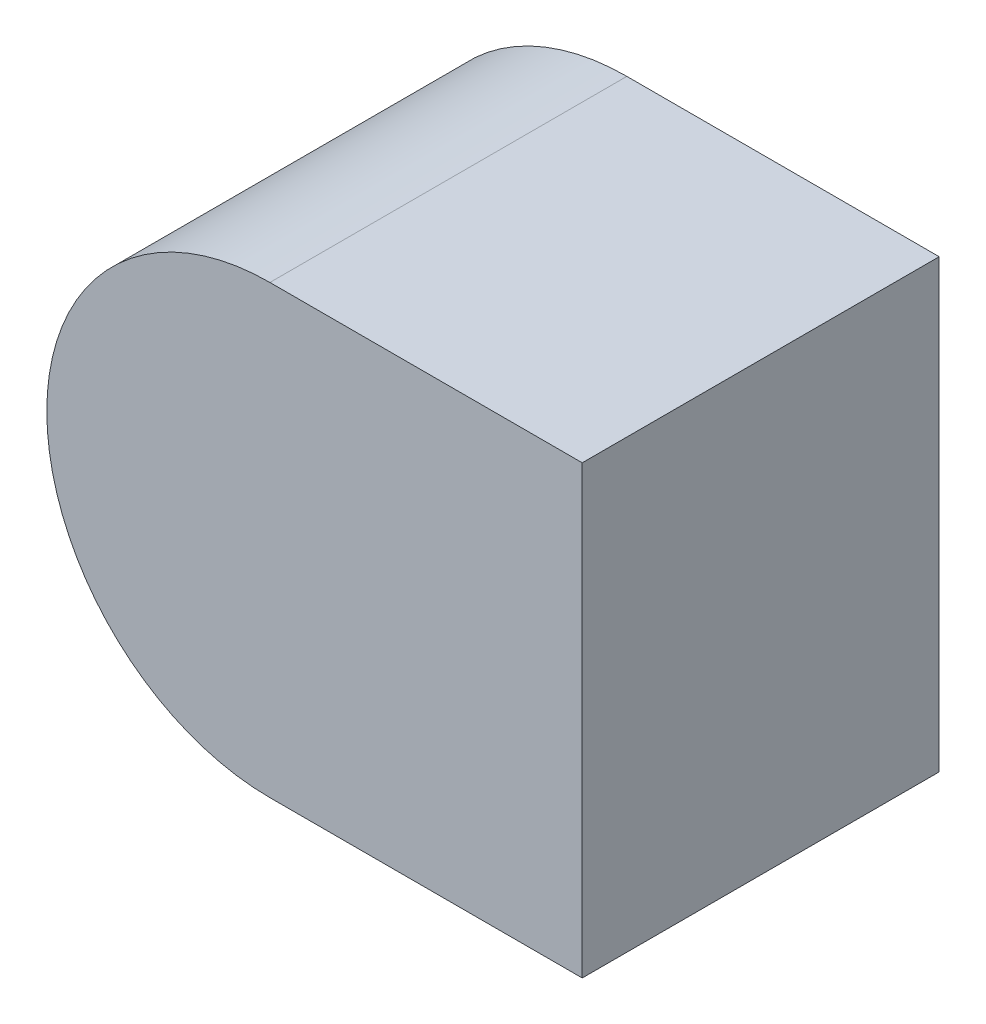
ISO-10303-21;
HEADER;
FILE_DESCRIPTION(('STEP AP214'),'2;1');
FILE_NAME('part.step','',(''),(''),'','','');
FILE_SCHEMA(('AUTOMOTIVE_DESIGN { 1 0 10303 214 1 1 1 1 }'));
ENDSEC;
DATA;
#1=APPLICATION_CONTEXT('core data for automotive mechanical design processes');
#2=APPLICATION_PROTOCOL_DEFINITION('international standard','automotive_design',2000,#1);
#3=PRODUCT_CONTEXT('',#1,'mechanical');
#4=PRODUCT('Part','Part','',(#3));
#5=PRODUCT_RELATED_PRODUCT_CATEGORY('part','',(#4));
#6=PRODUCT_DEFINITION_FORMATION('','',#4);
#7=PRODUCT_DEFINITION_CONTEXT('part definition',#1,'design');
#8=PRODUCT_DEFINITION('design','',#6,#7);
#9=PRODUCT_DEFINITION_SHAPE('','',#8);
#10=(LENGTH_UNIT() NAMED_UNIT(*) SI_UNIT(.MILLI.,.METRE.));
#11=(NAMED_UNIT(*) PLANE_ANGLE_UNIT() SI_UNIT($,.RADIAN.));
#12=(NAMED_UNIT(*) SI_UNIT($,.STERADIAN.) SOLID_ANGLE_UNIT());
#13=UNCERTAINTY_MEASURE_WITH_UNIT(LENGTH_MEASURE(1.E-05),#10,'distance_accuracy_value','');
#14=(GEOMETRIC_REPRESENTATION_CONTEXT(3) GLOBAL_UNCERTAINTY_ASSIGNED_CONTEXT((#13)) GLOBAL_UNIT_ASSIGNED_CONTEXT((#10,
#11,#12)) REPRESENTATION_CONTEXT('',''));
#15=CARTESIAN_POINT('',(0.,0.,0.));
#16=DIRECTION('',(0.,0.,1.));
#17=DIRECTION('',(1.,0.,0.));
#18=AXIS2_PLACEMENT_3D('',#15,#16,#17);
#19=CARTESIAN_POINT('',(0.703,-0.125,0.));
#20=DIRECTION('',(0.,-1.,0.));
#21=DIRECTION('',(1.,0.,0.));
#22=AXIS2_PLACEMENT_3D('',#19,#20,#21);
#23=PLANE('',#22);
#24=DIRECTION('',(0.,0.,1.));
#25=VECTOR('',#24,1.);
#26=CARTESIAN_POINT('',(0.828,-0.125,0.));
#27=LINE('',#26,#25);
#28=CARTESIAN_POINT('',(0.828,-0.125,0.));
#29=VERTEX_POINT('',#28);
#30=CARTESIAN_POINT('',(0.828,-0.125,0.2));
#31=VERTEX_POINT('',#30);
#32=EDGE_CURVE('E11',#29,#31,#27,.T.);
#33=ORIENTED_EDGE('',*,*,#32,.T.);
#34=DIRECTION('',(1.,0.,0.));
#35=VECTOR('',#34,1.);
#36=CARTESIAN_POINT('',(0.703,-0.125,0.2));
#37=LINE('',#36,#35);
#38=CARTESIAN_POINT('',(1.003,-0.125,0.2));
#39=VERTEX_POINT('',#38);
#40=EDGE_CURVE('E24',#31,#39,#37,.T.);
#41=ORIENTED_EDGE('',*,*,#40,.T.);
#42=DIRECTION('',(0.,0.,1.));
#43=VECTOR('',#42,1.);
#44=CARTESIAN_POINT('',(1.003,-0.125,0.));
#45=LINE('',#44,#43);
#46=CARTESIAN_POINT('',(1.003,-0.125,0.));
#47=VERTEX_POINT('',#46);
#48=EDGE_CURVE('E75',#47,#39,#45,.T.);
#49=ORIENTED_EDGE('',*,*,#48,.F.);
#50=DIRECTION('',(1.,0.,0.));
#51=VECTOR('',#50,1.);
#52=CARTESIAN_POINT('',(0.703,-0.125,0.));
#53=LINE('',#52,#51);
#54=EDGE_CURVE('E86',#29,#47,#53,.T.);
#55=ORIENTED_EDGE('',*,*,#54,.F.);
#56=EDGE_LOOP('',(#33,#41,#49,#55));
#57=FACE_BOUND('',#56,.T.);
#58=ADVANCED_FACE('F17',(#57),#23,.F.);
#59=CARTESIAN_POINT('',(0.852999999999999,-0.25,0.));
#60=DIRECTION('',(0.,0.,-1.));
#61=DIRECTION('',(-1.,0.,0.));
#62=AXIS2_PLACEMENT_3D('',#59,#60,#61);
#63=PLANE('',#62);
#64=CARTESIAN_POINT('',(0.828,-0.25,0.));
#65=DIRECTION('',(0.,0.,-1.));
#66=DIRECTION('',(-0.707106781186548,0.707106781186547,0.));
#67=AXIS2_PLACEMENT_3D('',#64,#65,#66);
#68=CIRCLE('',#67,0.125);
#69=CARTESIAN_POINT('',(0.828,-0.375,0.));
#70=VERTEX_POINT('',#69);
#71=EDGE_CURVE('E83',#70,#29,#68,.T.);
#72=ORIENTED_EDGE('',*,*,#71,.T.);
#73=ORIENTED_EDGE('',*,*,#54,.T.);
#74=DIRECTION('',(0.,-1.,0.));
#75=VECTOR('',#74,1.);
#76=CARTESIAN_POINT('',(1.003,-0.125,0.));
#77=LINE('',#76,#75);
#78=CARTESIAN_POINT('',(1.003,-0.375,0.));
#79=VERTEX_POINT('',#78);
#80=EDGE_CURVE('E81',#47,#79,#77,.T.);
#81=ORIENTED_EDGE('',*,*,#80,.T.);
#82=DIRECTION('',(-1.,0.,0.));
#83=VECTOR('',#82,1.);
#84=CARTESIAN_POINT('',(1.003,-0.375,0.));
#85=LINE('',#84,#83);
#86=EDGE_CURVE('E60',#79,#70,#85,.T.);
#87=ORIENTED_EDGE('',*,*,#86,.T.);
#88=EDGE_LOOP('',(#72,#73,#81,#87));
#89=FACE_BOUND('',#88,.T.);
#90=ADVANCED_FACE('F91',(#89),#63,.T.);
#91=CARTESIAN_POINT('',(0.828,-0.25,0.));
#92=DIRECTION('',(0.,0.,-1.));
#93=DIRECTION('',(-0.707106781186547,-0.707106781186548,0.));
#94=AXIS2_PLACEMENT_3D('',#91,#92,#93);
#95=CYLINDRICAL_SURFACE('',#94,0.125);
#96=CARTESIAN_POINT('',(0.828,-0.25,0.2));
#97=DIRECTION('',(0.,0.,1.));
#98=DIRECTION('',(-0.707106781186548,0.707106781186547,0.));
#99=AXIS2_PLACEMENT_3D('',#96,#97,#98);
#100=CIRCLE('',#99,0.125);
#101=CARTESIAN_POINT('',(0.828,-0.375,0.2));
#102=VERTEX_POINT('',#101);
#103=EDGE_CURVE('E70',#31,#102,#100,.T.);
#104=ORIENTED_EDGE('',*,*,#103,.F.);
#105=ORIENTED_EDGE('',*,*,#32,.F.);
#106=ORIENTED_EDGE('',*,*,#71,.F.);
#107=DIRECTION('',(0.,0.,-1.));
#108=VECTOR('',#107,1.);
#109=CARTESIAN_POINT('',(0.828,-0.375,0.));
#110=LINE('',#109,#108);
#111=EDGE_CURVE('E64',#102,#70,#110,.T.);
#112=ORIENTED_EDGE('',*,*,#111,.F.);
#113=EDGE_LOOP('',(#104,#105,#106,#112));
#114=FACE_BOUND('',#113,.T.);
#115=ADVANCED_FACE('F89',(#114),#95,.T.);
#116=CARTESIAN_POINT('',(1.003,-0.375,0.));
#117=DIRECTION('',(0.,1.,0.));
#118=DIRECTION('',(-1.,0.,0.));
#119=AXIS2_PLACEMENT_3D('',#116,#117,#118);
#120=PLANE('',#119);
#121=ORIENTED_EDGE('',*,*,#111,.T.);
#122=ORIENTED_EDGE('',*,*,#86,.F.);
#123=DIRECTION('',(0.,0.,1.));
#124=VECTOR('',#123,1.);
#125=CARTESIAN_POINT('',(1.003,-0.375,0.));
#126=LINE('',#125,#124);
#127=CARTESIAN_POINT('',(1.003,-0.375,0.2));
#128=VERTEX_POINT('',#127);
#129=EDGE_CURVE('E54',#79,#128,#126,.T.);
#130=ORIENTED_EDGE('',*,*,#129,.T.);
#131=DIRECTION('',(-1.,0.,0.));
#132=VECTOR('',#131,1.);
#133=CARTESIAN_POINT('',(1.003,-0.375,0.2));
#134=LINE('',#133,#132);
#135=EDGE_CURVE('E58',#128,#102,#134,.T.);
#136=ORIENTED_EDGE('',*,*,#135,.T.);
#137=EDGE_LOOP('',(#121,#122,#130,#136));
#138=FACE_BOUND('',#137,.T.);
#139=ADVANCED_FACE('F57',(#138),#120,.F.);
#140=CARTESIAN_POINT('',(1.003,-0.125,0.));
#141=DIRECTION('',(-1.,0.,0.));
#142=DIRECTION('',(0.,-1.,0.));
#143=AXIS2_PLACEMENT_3D('',#140,#141,#142);
#144=PLANE('',#143);
#145=ORIENTED_EDGE('',*,*,#80,.F.);
#146=ORIENTED_EDGE('',*,*,#48,.T.);
#147=DIRECTION('',(0.,-1.,0.));
#148=VECTOR('',#147,1.);
#149=CARTESIAN_POINT('',(1.003,-0.125,0.2));
#150=LINE('',#149,#148);
#151=EDGE_CURVE('E69',#39,#128,#150,.T.);
#152=ORIENTED_EDGE('',*,*,#151,.T.);
#153=ORIENTED_EDGE('',*,*,#129,.F.);
#154=EDGE_LOOP('',(#145,#146,#152,#153));
#155=FACE_BOUND('',#154,.T.);
#156=ADVANCED_FACE('F74',(#155),#144,.F.);
#157=CARTESIAN_POINT('',(0.852999999999999,-0.25,0.2));
#158=DIRECTION('',(0.,0.,-1.));
#159=DIRECTION('',(-1.,0.,0.));
#160=AXIS2_PLACEMENT_3D('',#157,#158,#159);
#161=PLANE('',#160);
#162=ORIENTED_EDGE('',*,*,#103,.T.);
#163=ORIENTED_EDGE('',*,*,#135,.F.);
#164=ORIENTED_EDGE('',*,*,#151,.F.);
#165=ORIENTED_EDGE('',*,*,#40,.F.);
#166=EDGE_LOOP('',(#162,#163,#164,#165));
#167=FACE_BOUND('',#166,.T.);
#168=ADVANCED_FACE('F68',(#167),#161,.F.);
#169=CLOSED_SHELL('',(#58,#90,#115,#139,#156,#168));
#170=MANIFOLD_SOLID_BREP('B1',#169);
#171=ADVANCED_BREP_SHAPE_REPRESENTATION('',(#18,#170),#14);
#172=SHAPE_DEFINITION_REPRESENTATION(#9,#171);
ENDSEC;
END-ISO-10303-21;
